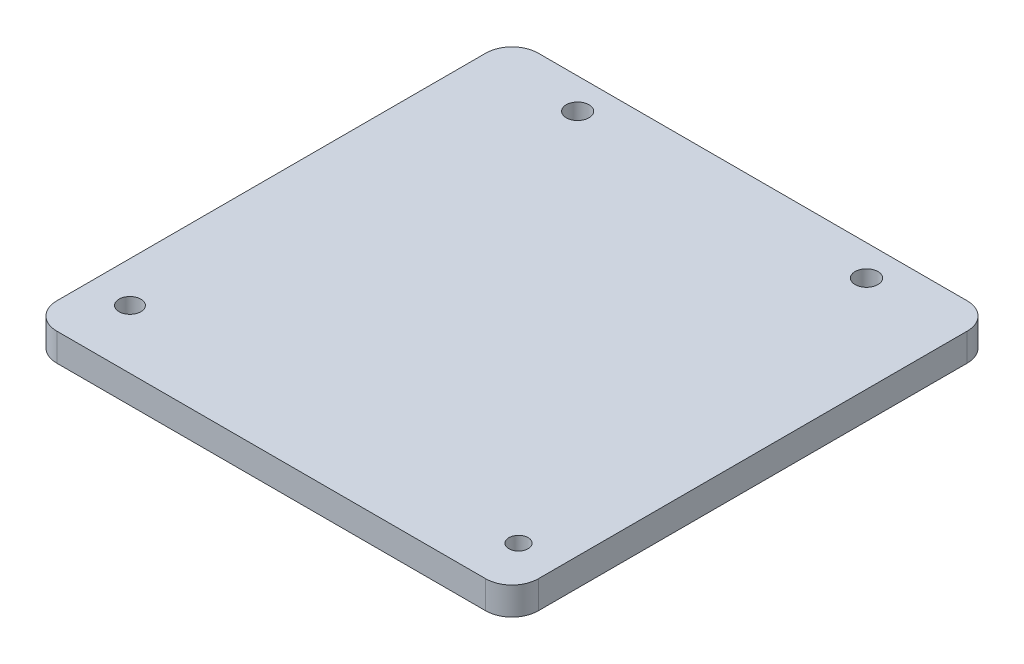
ISO-10303-21;
HEADER;
FILE_DESCRIPTION(('STEP AP214'),'2;1');
FILE_NAME('part.step','',(''),(''),'','','');
FILE_SCHEMA(('AUTOMOTIVE_DESIGN { 1 0 10303 214 1 1 1 1 }'));
ENDSEC;
DATA;
#1=APPLICATION_CONTEXT('core data for automotive mechanical design processes');
#2=APPLICATION_PROTOCOL_DEFINITION('international standard','automotive_design',2000,#1);
#3=PRODUCT_CONTEXT('',#1,'mechanical');
#4=PRODUCT('Part','Part','',(#3));
#5=PRODUCT_RELATED_PRODUCT_CATEGORY('part','',(#4));
#6=PRODUCT_DEFINITION_FORMATION('','',#4);
#7=PRODUCT_DEFINITION_CONTEXT('part definition',#1,'design');
#8=PRODUCT_DEFINITION('design','',#6,#7);
#9=PRODUCT_DEFINITION_SHAPE('','',#8);
#10=(LENGTH_UNIT() NAMED_UNIT(*) SI_UNIT(.MILLI.,.METRE.));
#11=(NAMED_UNIT(*) PLANE_ANGLE_UNIT() SI_UNIT($,.RADIAN.));
#12=(NAMED_UNIT(*) SI_UNIT($,.STERADIAN.) SOLID_ANGLE_UNIT());
#13=UNCERTAINTY_MEASURE_WITH_UNIT(LENGTH_MEASURE(1.E-05),#10,'distance_accuracy_value','');
#14=(GEOMETRIC_REPRESENTATION_CONTEXT(3) GLOBAL_UNCERTAINTY_ASSIGNED_CONTEXT((#13)) GLOBAL_UNIT_ASSIGNED_CONTEXT((#10,
#11,#12)) REPRESENTATION_CONTEXT('',''));
#15=CARTESIAN_POINT('',(0.,0.,0.));
#16=DIRECTION('',(0.,0.,1.));
#17=DIRECTION('',(1.,0.,0.));
#18=AXIS2_PLACEMENT_3D('',#15,#16,#17);
#19=CARTESIAN_POINT('',(27.5,3.175,-27.5));
#20=DIRECTION('',(-1.,0.,0.));
#21=DIRECTION('',(0.,0.,1.));
#22=AXIS2_PLACEMENT_3D('',#19,#20,#21);
#23=PLANE('',#22);
#24=DIRECTION('',(0.,0.,-1.));
#25=VECTOR('',#24,1.);
#26=CARTESIAN_POINT('',(27.5,3.175,-27.5));
#27=LINE('',#26,#25);
#28=CARTESIAN_POINT('',(27.5,3.175,24.5));
#29=VERTEX_POINT('',#28);
#30=CARTESIAN_POINT('',(27.5,3.175,-24.5));
#31=VERTEX_POINT('',#30);
#32=EDGE_CURVE('E125',#29,#31,#27,.T.);
#33=ORIENTED_EDGE('',*,*,#32,.F.);
#34=DIRECTION('',(0.,-1.,0.));
#35=VECTOR('',#34,1.);
#36=CARTESIAN_POINT('',(27.5,3.175,24.5));
#37=LINE('',#36,#35);
#38=CARTESIAN_POINT('',(27.5,0.,24.5));
#39=VERTEX_POINT('',#38);
#40=EDGE_CURVE('E151',#29,#39,#37,.T.);
#41=ORIENTED_EDGE('',*,*,#40,.T.);
#42=DIRECTION('',(0.,0.,-1.));
#43=VECTOR('',#42,1.);
#44=CARTESIAN_POINT('',(27.5,0.,-27.5));
#45=LINE('',#44,#43);
#46=CARTESIAN_POINT('',(27.5,0.,-24.5));
#47=VERTEX_POINT('',#46);
#48=EDGE_CURVE('E157',#39,#47,#45,.T.);
#49=ORIENTED_EDGE('',*,*,#48,.T.);
#50=DIRECTION('',(0.,-1.,0.));
#51=VECTOR('',#50,1.);
#52=CARTESIAN_POINT('',(27.5,3.175,-24.5));
#53=LINE('',#52,#51);
#54=EDGE_CURVE('E149',#47,#31,#53,.F.);
#55=ORIENTED_EDGE('',*,*,#54,.T.);
#56=EDGE_LOOP('',(#33,#41,#49,#55));
#57=FACE_BOUND('',#56,.T.);
#58=ADVANCED_FACE('F33',(#57),#23,.F.);
#59=CARTESIAN_POINT('',(-27.5,3.175,-27.5));
#60=DIRECTION('',(0.,0.,1.));
#61=DIRECTION('',(1.,0.,0.));
#62=AXIS2_PLACEMENT_3D('',#59,#60,#61);
#63=PLANE('',#62);
#64=DIRECTION('',(-1.,0.,0.));
#65=VECTOR('',#64,1.);
#66=CARTESIAN_POINT('',(-27.5,3.175,-27.5));
#67=LINE('',#66,#65);
#68=CARTESIAN_POINT('',(24.5,3.175,-27.5));
#69=VERTEX_POINT('',#68);
#70=CARTESIAN_POINT('',(-24.5,3.175,-27.5));
#71=VERTEX_POINT('',#70);
#72=EDGE_CURVE('E128',#69,#71,#67,.T.);
#73=ORIENTED_EDGE('',*,*,#72,.F.);
#74=DIRECTION('',(0.,-1.,0.));
#75=VECTOR('',#74,1.);
#76=CARTESIAN_POINT('',(24.5,3.175,-27.5));
#77=LINE('',#76,#75);
#78=CARTESIAN_POINT('',(24.5,0.,-27.5));
#79=VERTEX_POINT('',#78);
#80=EDGE_CURVE('E11',#69,#79,#77,.T.);
#81=ORIENTED_EDGE('',*,*,#80,.T.);
#82=DIRECTION('',(-1.,0.,0.));
#83=VECTOR('',#82,1.);
#84=CARTESIAN_POINT('',(-27.5,0.,-27.5));
#85=LINE('',#84,#83);
#86=CARTESIAN_POINT('',(-24.5,0.,-27.5));
#87=VERTEX_POINT('',#86);
#88=EDGE_CURVE('E130',#79,#87,#85,.T.);
#89=ORIENTED_EDGE('',*,*,#88,.T.);
#90=DIRECTION('',(0.,-1.,0.));
#91=VECTOR('',#90,1.);
#92=CARTESIAN_POINT('',(-24.5,3.175,-27.5));
#93=LINE('',#92,#91);
#94=EDGE_CURVE('E41',#87,#71,#93,.F.);
#95=ORIENTED_EDGE('',*,*,#94,.T.);
#96=EDGE_LOOP('',(#73,#81,#89,#95));
#97=FACE_BOUND('',#96,.T.);
#98=ADVANCED_FACE('F211',(#97),#63,.F.);
#99=CARTESIAN_POINT('',(-27.5,3.175,-27.5));
#100=DIRECTION('',(1.,0.,0.));
#101=DIRECTION('',(0.,0.,-1.));
#102=AXIS2_PLACEMENT_3D('',#99,#100,#101);
#103=PLANE('',#102);
#104=DIRECTION('',(0.,0.,1.));
#105=VECTOR('',#104,1.);
#106=CARTESIAN_POINT('',(-27.5,0.,-27.5));
#107=LINE('',#106,#105);
#108=CARTESIAN_POINT('',(-27.5,0.,-24.5));
#109=VERTEX_POINT('',#108);
#110=CARTESIAN_POINT('',(-27.5,0.,24.5));
#111=VERTEX_POINT('',#110);
#112=EDGE_CURVE('E126',#109,#111,#107,.T.);
#113=ORIENTED_EDGE('',*,*,#112,.T.);
#114=DIRECTION('',(0.,-1.,0.));
#115=VECTOR('',#114,1.);
#116=CARTESIAN_POINT('',(-27.5,3.175,24.5));
#117=LINE('',#116,#115);
#118=CARTESIAN_POINT('',(-27.5,3.175,24.5));
#119=VERTEX_POINT('',#118);
#120=EDGE_CURVE('E104',#111,#119,#117,.F.);
#121=ORIENTED_EDGE('',*,*,#120,.T.);
#122=DIRECTION('',(0.,0.,1.));
#123=VECTOR('',#122,1.);
#124=CARTESIAN_POINT('',(-27.5,3.175,-27.5));
#125=LINE('',#124,#123);
#126=CARTESIAN_POINT('',(-27.5,3.175,-24.5));
#127=VERTEX_POINT('',#126);
#128=EDGE_CURVE('E169',#127,#119,#125,.T.);
#129=ORIENTED_EDGE('',*,*,#128,.F.);
#130=DIRECTION('',(0.,-1.,0.));
#131=VECTOR('',#130,1.);
#132=CARTESIAN_POINT('',(-27.5,3.175,-24.5));
#133=LINE('',#132,#131);
#134=EDGE_CURVE('E109',#127,#109,#133,.T.);
#135=ORIENTED_EDGE('',*,*,#134,.T.);
#136=EDGE_LOOP('',(#113,#121,#129,#135));
#137=FACE_BOUND('',#136,.T.);
#138=ADVANCED_FACE('F209',(#137),#103,.F.);
#139=CARTESIAN_POINT('',(-27.5,3.175,27.5));
#140=DIRECTION('',(0.,0.,-1.));
#141=DIRECTION('',(-1.,0.,0.));
#142=AXIS2_PLACEMENT_3D('',#139,#140,#141);
#143=PLANE('',#142);
#144=DIRECTION('',(1.,0.,0.));
#145=VECTOR('',#144,1.);
#146=CARTESIAN_POINT('',(-27.5,3.175,27.5));
#147=LINE('',#146,#145);
#148=CARTESIAN_POINT('',(-24.5,3.175,27.5));
#149=VERTEX_POINT('',#148);
#150=CARTESIAN_POINT('',(24.5,3.175,27.5));
#151=VERTEX_POINT('',#150);
#152=EDGE_CURVE('E119',#149,#151,#147,.T.);
#153=ORIENTED_EDGE('',*,*,#152,.F.);
#154=DIRECTION('',(0.,-1.,0.));
#155=VECTOR('',#154,1.);
#156=CARTESIAN_POINT('',(-24.5,3.175,27.5));
#157=LINE('',#156,#155);
#158=CARTESIAN_POINT('',(-24.5,0.,27.5));
#159=VERTEX_POINT('',#158);
#160=EDGE_CURVE('E103',#149,#159,#157,.T.);
#161=ORIENTED_EDGE('',*,*,#160,.T.);
#162=DIRECTION('',(1.,0.,0.));
#163=VECTOR('',#162,1.);
#164=CARTESIAN_POINT('',(-27.5,0.,27.5));
#165=LINE('',#164,#163);
#166=CARTESIAN_POINT('',(24.5,0.,27.5));
#167=VERTEX_POINT('',#166);
#168=EDGE_CURVE('E116',#159,#167,#165,.T.);
#169=ORIENTED_EDGE('',*,*,#168,.T.);
#170=DIRECTION('',(0.,-1.,0.));
#171=VECTOR('',#170,1.);
#172=CARTESIAN_POINT('',(24.5,3.175,27.5));
#173=LINE('',#172,#171);
#174=EDGE_CURVE('E121',#167,#151,#173,.F.);
#175=ORIENTED_EDGE('',*,*,#174,.T.);
#176=EDGE_LOOP('',(#153,#161,#169,#175));
#177=FACE_BOUND('',#176,.T.);
#178=ADVANCED_FACE('F115',(#177),#143,.F.);
#179=CARTESIAN_POINT('',(0.,3.175,0.));
#180=DIRECTION('',(0.,1.,0.));
#181=DIRECTION('',(0.,0.,1.));
#182=AXIS2_PLACEMENT_3D('',#179,#180,#181);
#183=PLANE('',#182);
#184=CARTESIAN_POINT('',(-16.5,3.175,-24.));
#185=DIRECTION('',(0.,1.,0.));
#186=DIRECTION('',(0.,0.,1.));
#187=AXIS2_PLACEMENT_3D('',#184,#185,#186);
#188=CIRCLE('',#187,1.3);
#189=CARTESIAN_POINT('',(-16.5,3.175,-22.7));
#190=VERTEX_POINT('',#189);
#191=EDGE_CURVE('E185',#190,#190,#188,.T.);
#192=ORIENTED_EDGE('',*,*,#191,.F.);
#193=EDGE_LOOP('',(#192));
#194=FACE_BOUND('',#193,.T.);
#195=CARTESIAN_POINT('',(16.5,3.175,-24.));
#196=DIRECTION('',(0.,1.,0.));
#197=DIRECTION('',(0.,0.,-1.));
#198=AXIS2_PLACEMENT_3D('',#195,#196,#197);
#199=CIRCLE('',#198,1.3);
#200=CARTESIAN_POINT('',(16.5,3.175,-25.3));
#201=VERTEX_POINT('',#200);
#202=EDGE_CURVE('E186',#201,#201,#199,.T.);
#203=ORIENTED_EDGE('',*,*,#202,.F.);
#204=EDGE_LOOP('',(#203));
#205=FACE_BOUND('',#204,.T.);
#206=CARTESIAN_POINT('',(22.855,3.175,22.11));
#207=DIRECTION('',(0.,1.,0.));
#208=DIRECTION('',(0.,0.,1.));
#209=AXIS2_PLACEMENT_3D('',#206,#207,#208);
#210=CIRCLE('',#209,1.1);
#211=CARTESIAN_POINT('',(22.855,3.175,23.21));
#212=VERTEX_POINT('',#211);
#213=EDGE_CURVE('E165',#212,#212,#210,.T.);
#214=ORIENTED_EDGE('',*,*,#213,.F.);
#215=EDGE_LOOP('',(#214));
#216=FACE_BOUND('',#215,.T.);
#217=CARTESIAN_POINT('',(-22.865,3.175,20.78));
#218=DIRECTION('',(0.,1.,0.));
#219=DIRECTION('',(0.,0.,1.));
#220=AXIS2_PLACEMENT_3D('',#217,#218,#219);
#221=CIRCLE('',#220,1.25);
#222=CARTESIAN_POINT('',(-22.865,3.175,22.03));
#223=VERTEX_POINT('',#222);
#224=EDGE_CURVE('E176',#223,#223,#221,.T.);
#225=ORIENTED_EDGE('',*,*,#224,.F.);
#226=EDGE_LOOP('',(#225));
#227=FACE_BOUND('',#226,.T.);
#228=ORIENTED_EDGE('',*,*,#128,.T.);
#229=CARTESIAN_POINT('',(-24.5,3.175,24.5));
#230=DIRECTION('',(0.,1.,0.));
#231=DIRECTION('',(0.,0.,1.));
#232=AXIS2_PLACEMENT_3D('',#229,#230,#231);
#233=CIRCLE('',#232,3.);
#234=EDGE_CURVE('E147',#119,#149,#233,.T.);
#235=ORIENTED_EDGE('',*,*,#234,.T.);
#236=ORIENTED_EDGE('',*,*,#152,.T.);
#237=CARTESIAN_POINT('',(24.5,3.175,24.5));
#238=DIRECTION('',(0.,1.,0.));
#239=DIRECTION('',(0.,0.,1.));
#240=AXIS2_PLACEMENT_3D('',#237,#238,#239);
#241=CIRCLE('',#240,3.);
#242=EDGE_CURVE('E145',#151,#29,#241,.T.);
#243=ORIENTED_EDGE('',*,*,#242,.T.);
#244=ORIENTED_EDGE('',*,*,#32,.T.);
#245=CARTESIAN_POINT('',(24.5,3.175,-24.5));
#246=DIRECTION('',(0.,1.,0.));
#247=DIRECTION('',(0.,0.,1.));
#248=AXIS2_PLACEMENT_3D('',#245,#246,#247);
#249=CIRCLE('',#248,3.);
#250=EDGE_CURVE('E54',#31,#69,#249,.T.);
#251=ORIENTED_EDGE('',*,*,#250,.T.);
#252=ORIENTED_EDGE('',*,*,#72,.T.);
#253=CARTESIAN_POINT('',(-24.5,3.175,-24.5));
#254=DIRECTION('',(0.,1.,0.));
#255=DIRECTION('',(0.,0.,1.));
#256=AXIS2_PLACEMENT_3D('',#253,#254,#255);
#257=CIRCLE('',#256,3.);
#258=EDGE_CURVE('E142',#71,#127,#257,.T.);
#259=ORIENTED_EDGE('',*,*,#258,.T.);
#260=EDGE_LOOP('',(#228,#235,#236,#243,#244,#251,#252,#259));
#261=FACE_BOUND('',#260,.T.);
#262=ADVANCED_FACE('F196',(#194,#205,#216,#227,#261),#183,.T.);
#263=CARTESIAN_POINT('',(0.,0.,0.));
#264=DIRECTION('',(0.,1.,0.));
#265=DIRECTION('',(0.,0.,1.));
#266=AXIS2_PLACEMENT_3D('',#263,#264,#265);
#267=PLANE('',#266);
#268=CARTESIAN_POINT('',(-16.5,0.,-24.));
#269=DIRECTION('',(0.,1.,0.));
#270=DIRECTION('',(0.,0.,1.));
#271=AXIS2_PLACEMENT_3D('',#268,#269,#270);
#272=CIRCLE('',#271,1.3);
#273=CARTESIAN_POINT('',(-16.5,0.,-22.7));
#274=VERTEX_POINT('',#273);
#275=EDGE_CURVE('E178',#274,#274,#272,.F.);
#276=ORIENTED_EDGE('',*,*,#275,.F.);
#277=EDGE_LOOP('',(#276));
#278=FACE_BOUND('',#277,.T.);
#279=CARTESIAN_POINT('',(16.5,0.,-24.));
#280=DIRECTION('',(0.,1.,0.));
#281=DIRECTION('',(0.,0.,1.));
#282=AXIS2_PLACEMENT_3D('',#279,#280,#281);
#283=CIRCLE('',#282,1.3);
#284=CARTESIAN_POINT('',(16.5,0.,-22.7));
#285=VERTEX_POINT('',#284);
#286=EDGE_CURVE('E182',#285,#285,#283,.F.);
#287=ORIENTED_EDGE('',*,*,#286,.F.);
#288=EDGE_LOOP('',(#287));
#289=FACE_BOUND('',#288,.T.);
#290=CARTESIAN_POINT('',(22.855,0.,22.11));
#291=DIRECTION('',(0.,1.,0.));
#292=DIRECTION('',(0.,0.,1.));
#293=AXIS2_PLACEMENT_3D('',#290,#291,#292);
#294=CIRCLE('',#293,1.1);
#295=CARTESIAN_POINT('',(22.855,0.,23.21));
#296=VERTEX_POINT('',#295);
#297=EDGE_CURVE('E162',#296,#296,#294,.F.);
#298=ORIENTED_EDGE('',*,*,#297,.F.);
#299=EDGE_LOOP('',(#298));
#300=FACE_BOUND('',#299,.T.);
#301=CARTESIAN_POINT('',(-22.865,0.,20.78));
#302=DIRECTION('',(0.,1.,0.));
#303=DIRECTION('',(0.,0.,1.));
#304=AXIS2_PLACEMENT_3D('',#301,#302,#303);
#305=CIRCLE('',#304,1.25);
#306=CARTESIAN_POINT('',(-22.865,0.,22.03));
#307=VERTEX_POINT('',#306);
#308=EDGE_CURVE('E173',#307,#307,#305,.F.);
#309=ORIENTED_EDGE('',*,*,#308,.F.);
#310=EDGE_LOOP('',(#309));
#311=FACE_BOUND('',#310,.T.);
#312=ORIENTED_EDGE('',*,*,#168,.F.);
#313=CARTESIAN_POINT('',(-24.5,0.,24.5));
#314=DIRECTION('',(0.,1.,0.));
#315=DIRECTION('',(0.,0.,1.));
#316=AXIS2_PLACEMENT_3D('',#313,#314,#315);
#317=CIRCLE('',#316,3.);
#318=EDGE_CURVE('E99',#159,#111,#317,.F.);
#319=ORIENTED_EDGE('',*,*,#318,.T.);
#320=ORIENTED_EDGE('',*,*,#112,.F.);
#321=CARTESIAN_POINT('',(-24.5,0.,-24.5));
#322=DIRECTION('',(0.,1.,0.));
#323=DIRECTION('',(0.,0.,1.));
#324=AXIS2_PLACEMENT_3D('',#321,#322,#323);
#325=CIRCLE('',#324,3.);
#326=EDGE_CURVE('E120',#109,#87,#325,.F.);
#327=ORIENTED_EDGE('',*,*,#326,.T.);
#328=ORIENTED_EDGE('',*,*,#88,.F.);
#329=CARTESIAN_POINT('',(24.5,0.,-24.5));
#330=DIRECTION('',(0.,1.,0.));
#331=DIRECTION('',(0.,0.,1.));
#332=AXIS2_PLACEMENT_3D('',#329,#330,#331);
#333=CIRCLE('',#332,3.);
#334=EDGE_CURVE('E136',#79,#47,#333,.F.);
#335=ORIENTED_EDGE('',*,*,#334,.T.);
#336=ORIENTED_EDGE('',*,*,#48,.F.);
#337=CARTESIAN_POINT('',(24.5,0.,24.5));
#338=DIRECTION('',(0.,1.,0.));
#339=DIRECTION('',(0.,0.,1.));
#340=AXIS2_PLACEMENT_3D('',#337,#338,#339);
#341=CIRCLE('',#340,3.);
#342=EDGE_CURVE('E110',#39,#167,#341,.F.);
#343=ORIENTED_EDGE('',*,*,#342,.T.);
#344=EDGE_LOOP('',(#312,#319,#320,#327,#328,#335,#336,#343));
#345=FACE_BOUND('',#344,.T.);
#346=ADVANCED_FACE('F123',(#278,#289,#300,#311,#345),#267,.F.);
#347=CARTESIAN_POINT('',(-24.5,3.175,24.5));
#348=DIRECTION('',(0.,-1.,0.));
#349=DIRECTION('',(0.,0.,-1.));
#350=AXIS2_PLACEMENT_3D('',#347,#348,#349);
#351=CYLINDRICAL_SURFACE('',#350,3.);
#352=ORIENTED_EDGE('',*,*,#234,.F.);
#353=ORIENTED_EDGE('',*,*,#120,.F.);
#354=ORIENTED_EDGE('',*,*,#318,.F.);
#355=ORIENTED_EDGE('',*,*,#160,.F.);
#356=EDGE_LOOP('',(#352,#353,#354,#355));
#357=FACE_BOUND('',#356,.T.);
#358=ADVANCED_FACE('F102',(#357),#351,.T.);
#359=CARTESIAN_POINT('',(24.5,3.175,24.5));
#360=DIRECTION('',(0.,-1.,0.));
#361=DIRECTION('',(0.,0.,-1.));
#362=AXIS2_PLACEMENT_3D('',#359,#360,#361);
#363=CYLINDRICAL_SURFACE('',#362,3.);
#364=ORIENTED_EDGE('',*,*,#242,.F.);
#365=ORIENTED_EDGE('',*,*,#174,.F.);
#366=ORIENTED_EDGE('',*,*,#342,.F.);
#367=ORIENTED_EDGE('',*,*,#40,.F.);
#368=EDGE_LOOP('',(#364,#365,#366,#367));
#369=FACE_BOUND('',#368,.T.);
#370=ADVANCED_FACE('F215',(#369),#363,.T.);
#371=CARTESIAN_POINT('',(24.5,3.175,-24.5));
#372=DIRECTION('',(0.,-1.,0.));
#373=DIRECTION('',(0.,0.,-1.));
#374=AXIS2_PLACEMENT_3D('',#371,#372,#373);
#375=CYLINDRICAL_SURFACE('',#374,3.);
#376=ORIENTED_EDGE('',*,*,#250,.F.);
#377=ORIENTED_EDGE('',*,*,#54,.F.);
#378=ORIENTED_EDGE('',*,*,#334,.F.);
#379=ORIENTED_EDGE('',*,*,#80,.F.);
#380=EDGE_LOOP('',(#376,#377,#378,#379));
#381=FACE_BOUND('',#380,.T.);
#382=ADVANCED_FACE('F214',(#381),#375,.T.);
#383=CARTESIAN_POINT('',(-24.5,3.175,-24.5));
#384=DIRECTION('',(0.,-1.,0.));
#385=DIRECTION('',(0.,0.,-1.));
#386=AXIS2_PLACEMENT_3D('',#383,#384,#385);
#387=CYLINDRICAL_SURFACE('',#386,3.);
#388=ORIENTED_EDGE('',*,*,#258,.F.);
#389=ORIENTED_EDGE('',*,*,#94,.F.);
#390=ORIENTED_EDGE('',*,*,#326,.F.);
#391=ORIENTED_EDGE('',*,*,#134,.F.);
#392=EDGE_LOOP('',(#388,#389,#390,#391));
#393=FACE_BOUND('',#392,.T.);
#394=ADVANCED_FACE('F35',(#393),#387,.T.);
#395=CARTESIAN_POINT('',(-22.865,-3.53553390593274,20.78));
#396=DIRECTION('',(0.,1.,0.));
#397=DIRECTION('',(0.,0.,1.));
#398=AXIS2_PLACEMENT_3D('',#395,#396,#397);
#399=CYLINDRICAL_SURFACE('',#398,1.25);
#400=ORIENTED_EDGE('',*,*,#308,.T.);
#401=EDGE_LOOP('',(#400));
#402=FACE_BOUND('',#401,.T.);
#403=ORIENTED_EDGE('',*,*,#224,.T.);
#404=EDGE_LOOP('',(#403));
#405=FACE_BOUND('',#404,.T.);
#406=ADVANCED_FACE('F237',(#402,#405),#399,.F.);
#407=CARTESIAN_POINT('',(22.855,-3.53553390593274,22.11));
#408=DIRECTION('',(0.,1.,0.));
#409=DIRECTION('',(0.,0.,1.));
#410=AXIS2_PLACEMENT_3D('',#407,#408,#409);
#411=CYLINDRICAL_SURFACE('',#410,1.1);
#412=ORIENTED_EDGE('',*,*,#297,.T.);
#413=EDGE_LOOP('',(#412));
#414=FACE_BOUND('',#413,.T.);
#415=ORIENTED_EDGE('',*,*,#213,.T.);
#416=EDGE_LOOP('',(#415));
#417=FACE_BOUND('',#416,.T.);
#418=ADVANCED_FACE('F240',(#414,#417),#411,.F.);
#419=CARTESIAN_POINT('',(16.5,-3.67695526217004,-24.));
#420=DIRECTION('',(0.,1.,0.));
#421=DIRECTION('',(0.,0.,1.));
#422=AXIS2_PLACEMENT_3D('',#419,#420,#421);
#423=CYLINDRICAL_SURFACE('',#422,1.3);
#424=ORIENTED_EDGE('',*,*,#286,.T.);
#425=EDGE_LOOP('',(#424));
#426=FACE_BOUND('',#425,.T.);
#427=ORIENTED_EDGE('',*,*,#202,.T.);
#428=EDGE_LOOP('',(#427));
#429=FACE_BOUND('',#428,.T.);
#430=ADVANCED_FACE('F244',(#426,#429),#423,.F.);
#431=CARTESIAN_POINT('',(-16.5,-3.67695526217004,-24.));
#432=DIRECTION('',(0.,1.,0.));
#433=DIRECTION('',(0.,0.,1.));
#434=AXIS2_PLACEMENT_3D('',#431,#432,#433);
#435=CYLINDRICAL_SURFACE('',#434,1.3);
#436=ORIENTED_EDGE('',*,*,#275,.T.);
#437=EDGE_LOOP('',(#436));
#438=FACE_BOUND('',#437,.T.);
#439=ORIENTED_EDGE('',*,*,#191,.T.);
#440=EDGE_LOOP('',(#439));
#441=FACE_BOUND('',#440,.T.);
#442=ADVANCED_FACE('F194',(#438,#441),#435,.F.);
#443=CLOSED_SHELL('',(#58,#98,#138,#178,#262,#346,#358,#370,#382,#394,#406,#418,#430,#442));
#444=MANIFOLD_SOLID_BREP('B2',#443);
#445=ADVANCED_BREP_SHAPE_REPRESENTATION('',(#18,#444),#14);
#446=SHAPE_DEFINITION_REPRESENTATION(#9,#445);
ENDSEC;
END-ISO-10303-21;
